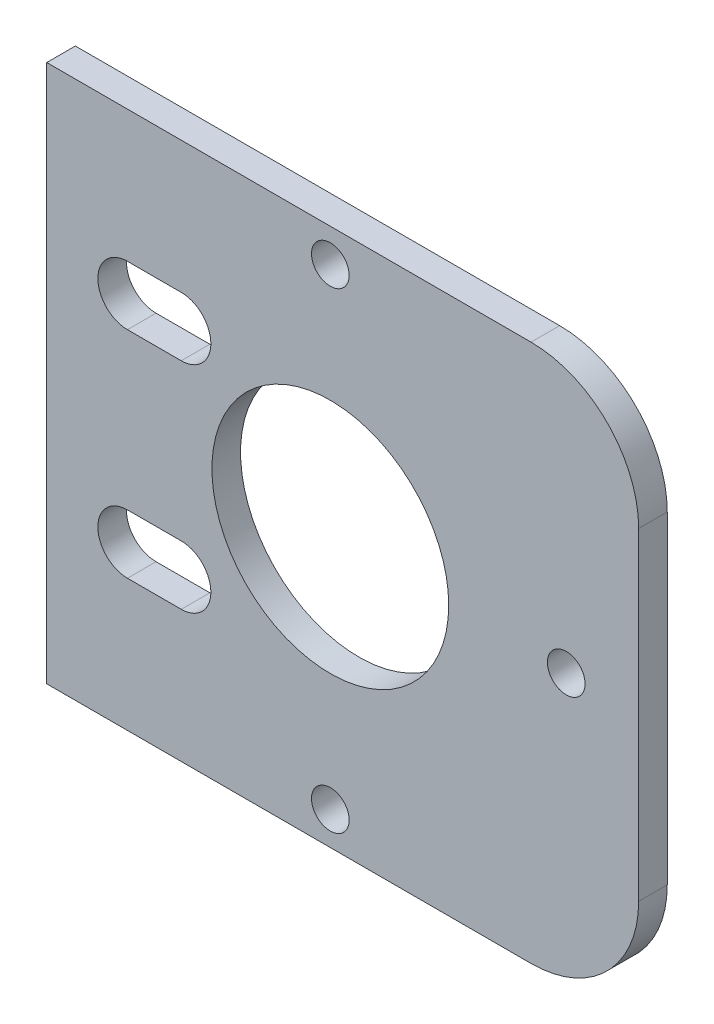
ISO-10303-21;
HEADER;
FILE_DESCRIPTION(('STEP AP214'),'2;1');
FILE_NAME('part.step','',(''),(''),'','','');
FILE_SCHEMA(('AUTOMOTIVE_DESIGN { 1 0 10303 214 1 1 1 1 }'));
ENDSEC;
DATA;
#1=APPLICATION_CONTEXT('core data for automotive mechanical design processes');
#2=APPLICATION_PROTOCOL_DEFINITION('international standard','automotive_design',2000,#1);
#3=PRODUCT_CONTEXT('',#1,'mechanical');
#4=PRODUCT('Part','Part','',(#3));
#5=PRODUCT_RELATED_PRODUCT_CATEGORY('part','',(#4));
#6=PRODUCT_DEFINITION_FORMATION('','',#4);
#7=PRODUCT_DEFINITION_CONTEXT('part definition',#1,'design');
#8=PRODUCT_DEFINITION('design','',#6,#7);
#9=PRODUCT_DEFINITION_SHAPE('','',#8);
#10=(LENGTH_UNIT() NAMED_UNIT(*) SI_UNIT(.MILLI.,.METRE.));
#11=(NAMED_UNIT(*) PLANE_ANGLE_UNIT() SI_UNIT($,.RADIAN.));
#12=(NAMED_UNIT(*) SI_UNIT($,.STERADIAN.) SOLID_ANGLE_UNIT());
#13=UNCERTAINTY_MEASURE_WITH_UNIT(LENGTH_MEASURE(1.E-05),#10,'distance_accuracy_value','');
#14=(GEOMETRIC_REPRESENTATION_CONTEXT(3) GLOBAL_UNCERTAINTY_ASSIGNED_CONTEXT((#13)) GLOBAL_UNIT_ASSIGNED_CONTEXT((#10,
#11,#12)) REPRESENTATION_CONTEXT('',''));
#15=CARTESIAN_POINT('',(0.,0.,0.));
#16=DIRECTION('',(0.,0.,1.));
#17=DIRECTION('',(1.,0.,0.));
#18=AXIS2_PLACEMENT_3D('',#15,#16,#17);
#19=CARTESIAN_POINT('',(17.5,0.,2.65684));
#20=DIRECTION('',(0.,0.,1.));
#21=DIRECTION('',(1.,0.,0.));
#22=AXIS2_PLACEMENT_3D('',#19,#20,#21);
#23=PLANE('',#22);
#24=DIRECTION('',(0.,-1.,0.));
#25=VECTOR('',#24,1.);
#26=CARTESIAN_POINT('',(-10.,25.,2.65684));
#27=LINE('',#26,#25);
#28=CARTESIAN_POINT('',(-10.,-25.,2.65684));
#29=VERTEX_POINT('',#28);
#30=CARTESIAN_POINT('',(-10.,25.,2.65684));
#31=VERTEX_POINT('',#30);
#32=EDGE_CURVE('E160',#29,#31,#27,.F.);
#33=ORIENTED_EDGE('',*,*,#32,.F.);
#34=DIRECTION('',(1.,0.,0.));
#35=VECTOR('',#34,1.);
#36=CARTESIAN_POINT('',(-10.,-25.,2.65684));
#37=LINE('',#36,#35);
#38=CARTESIAN_POINT('',(35.,-25.,2.65684));
#39=VERTEX_POINT('',#38);
#40=EDGE_CURVE('E153',#39,#29,#37,.F.);
#41=ORIENTED_EDGE('',*,*,#40,.F.);
#42=CARTESIAN_POINT('',(35.,-15.,2.65684));
#43=DIRECTION('',(0.,0.,1.));
#44=DIRECTION('',(1.,0.,0.));
#45=AXIS2_PLACEMENT_3D('',#42,#43,#44);
#46=CIRCLE('',#45,10.);
#47=CARTESIAN_POINT('',(45.,-15.,2.65684));
#48=VERTEX_POINT('',#47);
#49=EDGE_CURVE('E125',#48,#39,#46,.F.);
#50=ORIENTED_EDGE('',*,*,#49,.F.);
#51=DIRECTION('',(0.,1.,0.));
#52=VECTOR('',#51,1.);
#53=CARTESIAN_POINT('',(45.,-25.,2.65684));
#54=LINE('',#53,#52);
#55=CARTESIAN_POINT('',(45.,15.,2.65684));
#56=VERTEX_POINT('',#55);
#57=EDGE_CURVE('E120',#56,#48,#54,.F.);
#58=ORIENTED_EDGE('',*,*,#57,.F.);
#59=CARTESIAN_POINT('',(35.,15.,2.65684));
#60=DIRECTION('',(0.,0.,1.));
#61=DIRECTION('',(1.,0.,0.));
#62=AXIS2_PLACEMENT_3D('',#59,#60,#61);
#63=CIRCLE('',#62,10.);
#64=CARTESIAN_POINT('',(35.,25.,2.65684));
#65=VERTEX_POINT('',#64);
#66=EDGE_CURVE('E19',#65,#56,#63,.F.);
#67=ORIENTED_EDGE('',*,*,#66,.F.);
#68=DIRECTION('',(-1.,0.,0.));
#69=VECTOR('',#68,1.);
#70=CARTESIAN_POINT('',(45.,25.,2.65684));
#71=LINE('',#70,#69);
#72=EDGE_CURVE('E134',#31,#65,#71,.F.);
#73=ORIENTED_EDGE('',*,*,#72,.F.);
#74=EDGE_LOOP('',(#33,#41,#50,#58,#67,#73));
#75=FACE_BOUND('',#74,.T.);
#76=CARTESIAN_POINT('',(38.2703,0.,2.65684));
#77=DIRECTION('',(0.,0.,1.));
#78=DIRECTION('',(1.,0.,0.));
#79=AXIS2_PLACEMENT_3D('',#76,#77,#78);
#80=CIRCLE('',#79,1.75);
#81=CARTESIAN_POINT('',(40.0203,0.,2.65684));
#82=VERTEX_POINT('',#81);
#83=EDGE_CURVE('E197',#82,#82,#80,.F.);
#84=ORIENTED_EDGE('',*,*,#83,.T.);
#85=EDGE_LOOP('',(#84));
#86=FACE_BOUND('',#85,.T.);
#87=CARTESIAN_POINT('',(16.35,21.9203,2.65684));
#88=DIRECTION('',(0.,0.,1.));
#89=DIRECTION('',(1.,0.,0.));
#90=AXIS2_PLACEMENT_3D('',#87,#88,#89);
#91=CIRCLE('',#90,1.75);
#92=CARTESIAN_POINT('',(18.1,21.9203,2.65684));
#93=VERTEX_POINT('',#92);
#94=EDGE_CURVE('E200',#93,#93,#91,.F.);
#95=ORIENTED_EDGE('',*,*,#94,.T.);
#96=EDGE_LOOP('',(#95));
#97=FACE_BOUND('',#96,.T.);
#98=CARTESIAN_POINT('',(16.35,-21.9203,2.65684));
#99=DIRECTION('',(0.,0.,1.));
#100=DIRECTION('',(1.,0.,0.));
#101=AXIS2_PLACEMENT_3D('',#98,#99,#100);
#102=CIRCLE('',#101,1.75);
#103=CARTESIAN_POINT('',(18.1,-21.9203,2.65684));
#104=VERTEX_POINT('',#103);
#105=EDGE_CURVE('E203',#104,#104,#102,.F.);
#106=ORIENTED_EDGE('',*,*,#105,.T.);
#107=EDGE_LOOP('',(#106));
#108=FACE_BOUND('',#107,.T.);
#109=CARTESIAN_POINT('',(2.50000000000001,-10.,2.65684));
#110=DIRECTION('',(0.,0.,1.));
#111=DIRECTION('',(1.,0.,0.));
#112=AXIS2_PLACEMENT_3D('',#109,#110,#111);
#113=CIRCLE('',#112,2.75);
#114=CARTESIAN_POINT('',(2.50000000000001,-7.25,2.65684));
#115=VERTEX_POINT('',#114);
#116=CARTESIAN_POINT('',(2.50000000000001,-12.75,2.65684));
#117=VERTEX_POINT('',#116);
#118=EDGE_CURVE('E210',#115,#117,#113,.F.);
#119=ORIENTED_EDGE('',*,*,#118,.T.);
#120=DIRECTION('',(1.,0.,0.));
#121=VECTOR('',#120,1.);
#122=CARTESIAN_POINT('',(-2.49999999999999,-12.75,2.65684));
#123=LINE('',#122,#121);
#124=CARTESIAN_POINT('',(-2.49999999999999,-12.75,2.65684));
#125=VERTEX_POINT('',#124);
#126=EDGE_CURVE('E142',#117,#125,#123,.F.);
#127=ORIENTED_EDGE('',*,*,#126,.T.);
#128=CARTESIAN_POINT('',(-2.49999999999999,-10.,2.65684));
#129=DIRECTION('',(0.,0.,1.));
#130=DIRECTION('',(1.,0.,0.));
#131=AXIS2_PLACEMENT_3D('',#128,#129,#130);
#132=CIRCLE('',#131,2.75);
#133=CARTESIAN_POINT('',(-2.49999999999999,-7.25,2.65684));
#134=VERTEX_POINT('',#133);
#135=EDGE_CURVE('E207',#125,#134,#132,.F.);
#136=ORIENTED_EDGE('',*,*,#135,.T.);
#137=DIRECTION('',(1.,0.,0.));
#138=VECTOR('',#137,1.);
#139=CARTESIAN_POINT('',(2.50000000000001,-7.25,2.65684));
#140=LINE('',#139,#138);
#141=EDGE_CURVE('E138',#134,#115,#140,.T.);
#142=ORIENTED_EDGE('',*,*,#141,.T.);
#143=EDGE_LOOP('',(#119,#127,#136,#142));
#144=FACE_BOUND('',#143,.T.);
#145=CARTESIAN_POINT('',(-2.49999999999999,10.,2.65684));
#146=DIRECTION('',(0.,0.,1.));
#147=DIRECTION('',(1.,0.,0.));
#148=AXIS2_PLACEMENT_3D('',#145,#146,#147);
#149=CIRCLE('',#148,2.75);
#150=CARTESIAN_POINT('',(-2.49999999999999,7.25,2.65684));
#151=VERTEX_POINT('',#150);
#152=CARTESIAN_POINT('',(-2.49999999999999,12.75,2.65684));
#153=VERTEX_POINT('',#152);
#154=EDGE_CURVE('E215',#151,#153,#149,.F.);
#155=ORIENTED_EDGE('',*,*,#154,.T.);
#156=DIRECTION('',(1.,0.,0.));
#157=VECTOR('',#156,1.);
#158=CARTESIAN_POINT('',(2.50000000000001,12.75,2.65684));
#159=LINE('',#158,#157);
#160=CARTESIAN_POINT('',(2.50000000000001,12.75,2.65684));
#161=VERTEX_POINT('',#160);
#162=EDGE_CURVE('E149',#153,#161,#159,.T.);
#163=ORIENTED_EDGE('',*,*,#162,.T.);
#164=CARTESIAN_POINT('',(2.50000000000001,10.,2.65684));
#165=DIRECTION('',(0.,0.,1.));
#166=DIRECTION('',(1.,0.,0.));
#167=AXIS2_PLACEMENT_3D('',#164,#165,#166);
#168=CIRCLE('',#167,2.75);
#169=CARTESIAN_POINT('',(2.50000000000001,7.25,2.65684));
#170=VERTEX_POINT('',#169);
#171=EDGE_CURVE('E212',#161,#170,#168,.F.);
#172=ORIENTED_EDGE('',*,*,#171,.T.);
#173=DIRECTION('',(1.,0.,0.));
#174=VECTOR('',#173,1.);
#175=CARTESIAN_POINT('',(-2.49999999999999,7.25,2.65684));
#176=LINE('',#175,#174);
#177=EDGE_CURVE('E145',#170,#151,#176,.F.);
#178=ORIENTED_EDGE('',*,*,#177,.T.);
#179=EDGE_LOOP('',(#155,#163,#172,#178));
#180=FACE_BOUND('',#179,.T.);
#181=CARTESIAN_POINT('',(16.35,0.,2.65684));
#182=DIRECTION('',(0.,0.,1.));
#183=DIRECTION('',(1.,0.,0.));
#184=AXIS2_PLACEMENT_3D('',#181,#182,#183);
#185=CIRCLE('',#184,11.);
#186=CARTESIAN_POINT('',(27.35,0.,2.65684));
#187=VERTEX_POINT('',#186);
#188=EDGE_CURVE('E148',#187,#187,#185,.F.);
#189=ORIENTED_EDGE('',*,*,#188,.T.);
#190=EDGE_LOOP('',(#189));
#191=FACE_BOUND('',#190,.T.);
#192=ADVANCED_FACE('F16',(#75,#86,#97,#108,#144,#180,#191),#23,.T.);
#193=CARTESIAN_POINT('',(45.,-25.,0.));
#194=DIRECTION('',(1.,0.,0.));
#195=DIRECTION('',(0.,1.,0.));
#196=AXIS2_PLACEMENT_3D('',#193,#194,#195);
#197=PLANE('',#196);
#198=DIRECTION('',(0.,0.,1.));
#199=VECTOR('',#198,1.);
#200=CARTESIAN_POINT('',(45.,15.,0.));
#201=LINE('',#200,#199);
#202=CARTESIAN_POINT('',(45.,15.,0.));
#203=VERTEX_POINT('',#202);
#204=EDGE_CURVE('E117',#56,#203,#201,.F.);
#205=ORIENTED_EDGE('',*,*,#204,.F.);
#206=ORIENTED_EDGE('',*,*,#57,.T.);
#207=DIRECTION('',(0.,0.,1.));
#208=VECTOR('',#207,1.);
#209=CARTESIAN_POINT('',(45.,-15.,0.));
#210=LINE('',#209,#208);
#211=CARTESIAN_POINT('',(45.,-15.,0.));
#212=VERTEX_POINT('',#211);
#213=EDGE_CURVE('E218',#212,#48,#210,.T.);
#214=ORIENTED_EDGE('',*,*,#213,.F.);
#215=DIRECTION('',(0.,1.,0.));
#216=VECTOR('',#215,1.);
#217=CARTESIAN_POINT('',(45.,0.,0.));
#218=LINE('',#217,#216);
#219=EDGE_CURVE('E132',#212,#203,#218,.T.);
#220=ORIENTED_EDGE('',*,*,#219,.T.);
#221=EDGE_LOOP('',(#205,#206,#214,#220));
#222=FACE_BOUND('',#221,.T.);
#223=ADVANCED_FACE('F131',(#222),#197,.T.);
#224=CARTESIAN_POINT('',(35.,15.,0.));
#225=DIRECTION('',(0.,0.,1.));
#226=DIRECTION('',(1.,0.,0.));
#227=AXIS2_PLACEMENT_3D('',#224,#225,#226);
#228=CYLINDRICAL_SURFACE('',#227,10.);
#229=CARTESIAN_POINT('',(35.,15.,0.));
#230=DIRECTION('',(0.,0.,1.));
#231=DIRECTION('',(1.,0.,0.));
#232=AXIS2_PLACEMENT_3D('',#229,#230,#231);
#233=CIRCLE('',#232,10.);
#234=CARTESIAN_POINT('',(35.,25.,0.));
#235=VERTEX_POINT('',#234);
#236=EDGE_CURVE('E194',#203,#235,#233,.T.);
#237=ORIENTED_EDGE('',*,*,#236,.T.);
#238=DIRECTION('',(0.,0.,1.));
#239=VECTOR('',#238,1.);
#240=CARTESIAN_POINT('',(35.,25.,0.));
#241=LINE('',#240,#239);
#242=EDGE_CURVE('E119',#65,#235,#241,.F.);
#243=ORIENTED_EDGE('',*,*,#242,.F.);
#244=ORIENTED_EDGE('',*,*,#66,.T.);
#245=ORIENTED_EDGE('',*,*,#204,.T.);
#246=EDGE_LOOP('',(#237,#243,#244,#245));
#247=FACE_BOUND('',#246,.T.);
#248=ADVANCED_FACE('F115',(#247),#228,.T.);
#249=CARTESIAN_POINT('',(45.,25.,0.));
#250=DIRECTION('',(0.,1.,0.));
#251=DIRECTION('',(-1.,0.,0.));
#252=AXIS2_PLACEMENT_3D('',#249,#250,#251);
#253=PLANE('',#252);
#254=DIRECTION('',(0.,0.,1.));
#255=VECTOR('',#254,1.);
#256=CARTESIAN_POINT('',(-10.,25.,0.));
#257=LINE('',#256,#255);
#258=CARTESIAN_POINT('',(-9.99999999999999,25.,0.));
#259=VERTEX_POINT('',#258);
#260=EDGE_CURVE('E157',#31,#259,#257,.F.);
#261=ORIENTED_EDGE('',*,*,#260,.F.);
#262=ORIENTED_EDGE('',*,*,#72,.T.);
#263=ORIENTED_EDGE('',*,*,#242,.T.);
#264=DIRECTION('',(1.,0.,0.));
#265=VECTOR('',#264,1.);
#266=CARTESIAN_POINT('',(17.5,25.,0.));
#267=LINE('',#266,#265);
#268=EDGE_CURVE('E196',#235,#259,#267,.F.);
#269=ORIENTED_EDGE('',*,*,#268,.T.);
#270=EDGE_LOOP('',(#261,#262,#263,#269));
#271=FACE_BOUND('',#270,.T.);
#272=ADVANCED_FACE('F250',(#271),#253,.T.);
#273=CARTESIAN_POINT('',(-10.,25.,0.));
#274=DIRECTION('',(-1.,0.,0.));
#275=DIRECTION('',(0.,-1.,0.));
#276=AXIS2_PLACEMENT_3D('',#273,#274,#275);
#277=PLANE('',#276);
#278=ORIENTED_EDGE('',*,*,#32,.T.);
#279=ORIENTED_EDGE('',*,*,#260,.T.);
#280=DIRECTION('',(0.,1.,0.));
#281=VECTOR('',#280,1.);
#282=CARTESIAN_POINT('',(-9.99999999999999,0.,0.));
#283=LINE('',#282,#281);
#284=CARTESIAN_POINT('',(-9.99999999999999,-25.,0.));
#285=VERTEX_POINT('',#284);
#286=EDGE_CURVE('E232',#259,#285,#283,.F.);
#287=ORIENTED_EDGE('',*,*,#286,.T.);
#288=DIRECTION('',(0.,0.,1.));
#289=VECTOR('',#288,1.);
#290=CARTESIAN_POINT('',(-10.,-25.,0.));
#291=LINE('',#290,#289);
#292=EDGE_CURVE('E156',#29,#285,#291,.F.);
#293=ORIENTED_EDGE('',*,*,#292,.F.);
#294=EDGE_LOOP('',(#278,#279,#287,#293));
#295=FACE_BOUND('',#294,.T.);
#296=ADVANCED_FACE('F242',(#295),#277,.T.);
#297=CARTESIAN_POINT('',(-10.,-25.,0.));
#298=DIRECTION('',(0.,-1.,0.));
#299=DIRECTION('',(1.,0.,0.));
#300=AXIS2_PLACEMENT_3D('',#297,#298,#299);
#301=PLANE('',#300);
#302=ORIENTED_EDGE('',*,*,#292,.T.);
#303=DIRECTION('',(1.,0.,0.));
#304=VECTOR('',#303,1.);
#305=CARTESIAN_POINT('',(17.5,-25.,0.));
#306=LINE('',#305,#304);
#307=CARTESIAN_POINT('',(35.,-25.,0.));
#308=VERTEX_POINT('',#307);
#309=EDGE_CURVE('E193',#285,#308,#306,.T.);
#310=ORIENTED_EDGE('',*,*,#309,.T.);
#311=DIRECTION('',(0.,0.,1.));
#312=VECTOR('',#311,1.);
#313=CARTESIAN_POINT('',(35.,-25.,0.));
#314=LINE('',#313,#312);
#315=EDGE_CURVE('E219',#39,#308,#314,.F.);
#316=ORIENTED_EDGE('',*,*,#315,.F.);
#317=ORIENTED_EDGE('',*,*,#40,.T.);
#318=EDGE_LOOP('',(#302,#310,#316,#317));
#319=FACE_BOUND('',#318,.T.);
#320=ADVANCED_FACE('F292',(#319),#301,.T.);
#321=CARTESIAN_POINT('',(35.,-15.,0.));
#322=DIRECTION('',(0.,0.,1.));
#323=DIRECTION('',(1.,0.,0.));
#324=AXIS2_PLACEMENT_3D('',#321,#322,#323);
#325=CYLINDRICAL_SURFACE('',#324,10.);
#326=CARTESIAN_POINT('',(35.,-15.,0.));
#327=DIRECTION('',(0.,0.,1.));
#328=DIRECTION('',(1.,0.,0.));
#329=AXIS2_PLACEMENT_3D('',#326,#327,#328);
#330=CIRCLE('',#329,10.);
#331=EDGE_CURVE('E190',#308,#212,#330,.T.);
#332=ORIENTED_EDGE('',*,*,#331,.T.);
#333=ORIENTED_EDGE('',*,*,#213,.T.);
#334=ORIENTED_EDGE('',*,*,#49,.T.);
#335=ORIENTED_EDGE('',*,*,#315,.T.);
#336=EDGE_LOOP('',(#332,#333,#334,#335));
#337=FACE_BOUND('',#336,.T.);
#338=ADVANCED_FACE('F293',(#337),#325,.T.);
#339=CARTESIAN_POINT('',(16.35,0.,0.));
#340=DIRECTION('',(0.,0.,1.));
#341=DIRECTION('',(1.,0.,0.));
#342=AXIS2_PLACEMENT_3D('',#339,#340,#341);
#343=CYLINDRICAL_SURFACE('',#342,11.);
#344=CARTESIAN_POINT('',(16.35,0.,0.));
#345=DIRECTION('',(0.,0.,1.));
#346=DIRECTION('',(1.,0.,0.));
#347=AXIS2_PLACEMENT_3D('',#344,#345,#346);
#348=CIRCLE('',#347,11.);
#349=CARTESIAN_POINT('',(27.35,0.,0.));
#350=VERTEX_POINT('',#349);
#351=EDGE_CURVE('E187',#350,#350,#348,.F.);
#352=ORIENTED_EDGE('',*,*,#351,.T.);
#353=EDGE_LOOP('',(#352));
#354=FACE_BOUND('',#353,.T.);
#355=ORIENTED_EDGE('',*,*,#188,.F.);
#356=EDGE_LOOP('',(#355));
#357=FACE_BOUND('',#356,.T.);
#358=ADVANCED_FACE('F295',(#354,#357),#343,.F.);
#359=CARTESIAN_POINT('',(-2.49999999999999,7.25,0.));
#360=DIRECTION('',(0.,-1.,0.));
#361=DIRECTION('',(0.,0.,-1.));
#362=AXIS2_PLACEMENT_3D('',#359,#360,#361);
#363=PLANE('',#362);
#364=DIRECTION('',(0.,0.,1.));
#365=VECTOR('',#364,1.);
#366=CARTESIAN_POINT('',(-2.49999999999999,7.25,0.));
#367=LINE('',#366,#365);
#368=CARTESIAN_POINT('',(-2.49999999999999,7.25,0.));
#369=VERTEX_POINT('',#368);
#370=EDGE_CURVE('E147',#369,#151,#367,.T.);
#371=ORIENTED_EDGE('',*,*,#370,.T.);
#372=ORIENTED_EDGE('',*,*,#177,.F.);
#373=DIRECTION('',(0.,0.,1.));
#374=VECTOR('',#373,1.);
#375=CARTESIAN_POINT('',(2.50000000000001,7.25,0.));
#376=LINE('',#375,#374);
#377=CARTESIAN_POINT('',(2.50000000000001,7.25,0.));
#378=VERTEX_POINT('',#377);
#379=EDGE_CURVE('E141',#170,#378,#376,.F.);
#380=ORIENTED_EDGE('',*,*,#379,.T.);
#381=DIRECTION('',(1.,0.,0.));
#382=VECTOR('',#381,1.);
#383=CARTESIAN_POINT('',(17.5,7.25,0.));
#384=LINE('',#383,#382);
#385=EDGE_CURVE('E186',#378,#369,#384,.F.);
#386=ORIENTED_EDGE('',*,*,#385,.T.);
#387=EDGE_LOOP('',(#371,#372,#380,#386));
#388=FACE_BOUND('',#387,.T.);
#389=ADVANCED_FACE('F275',(#388),#363,.F.);
#390=CARTESIAN_POINT('',(-2.49999999999999,10.,0.));
#391=DIRECTION('',(0.,0.,1.));
#392=DIRECTION('',(1.,0.,0.));
#393=AXIS2_PLACEMENT_3D('',#390,#391,#392);
#394=CYLINDRICAL_SURFACE('',#393,2.75);
#395=DIRECTION('',(0.,0.,1.));
#396=VECTOR('',#395,1.);
#397=CARTESIAN_POINT('',(-2.49999999999999,12.75,0.));
#398=LINE('',#397,#396);
#399=CARTESIAN_POINT('',(-2.49999999999999,12.75,0.));
#400=VERTEX_POINT('',#399);
#401=EDGE_CURVE('E151',#400,#153,#398,.T.);
#402=ORIENTED_EDGE('',*,*,#401,.T.);
#403=ORIENTED_EDGE('',*,*,#154,.F.);
#404=ORIENTED_EDGE('',*,*,#370,.F.);
#405=CARTESIAN_POINT('',(-2.49999999999999,10.,0.));
#406=DIRECTION('',(0.,0.,1.));
#407=DIRECTION('',(1.,0.,0.));
#408=AXIS2_PLACEMENT_3D('',#405,#406,#407);
#409=CIRCLE('',#408,2.75);
#410=EDGE_CURVE('E183',#369,#400,#409,.F.);
#411=ORIENTED_EDGE('',*,*,#410,.T.);
#412=EDGE_LOOP('',(#402,#403,#404,#411));
#413=FACE_BOUND('',#412,.T.);
#414=ADVANCED_FACE('F280',(#413),#394,.F.);
#415=CARTESIAN_POINT('',(2.50000000000001,12.75,0.));
#416=DIRECTION('',(0.,1.,0.));
#417=DIRECTION('',(0.,0.,1.));
#418=AXIS2_PLACEMENT_3D('',#415,#416,#417);
#419=PLANE('',#418);
#420=DIRECTION('',(0.,0.,1.));
#421=VECTOR('',#420,1.);
#422=CARTESIAN_POINT('',(2.50000000000001,12.75,0.));
#423=LINE('',#422,#421);
#424=CARTESIAN_POINT('',(2.50000000000001,12.75,0.));
#425=VERTEX_POINT('',#424);
#426=EDGE_CURVE('E150',#425,#161,#423,.T.);
#427=ORIENTED_EDGE('',*,*,#426,.T.);
#428=ORIENTED_EDGE('',*,*,#162,.F.);
#429=ORIENTED_EDGE('',*,*,#401,.F.);
#430=DIRECTION('',(1.,0.,0.));
#431=VECTOR('',#430,1.);
#432=CARTESIAN_POINT('',(17.5,12.75,0.));
#433=LINE('',#432,#431);
#434=EDGE_CURVE('E182',#400,#425,#433,.T.);
#435=ORIENTED_EDGE('',*,*,#434,.T.);
#436=EDGE_LOOP('',(#427,#428,#429,#435));
#437=FACE_BOUND('',#436,.T.);
#438=ADVANCED_FACE('F343',(#437),#419,.F.);
#439=CARTESIAN_POINT('',(2.50000000000001,10.,0.));
#440=DIRECTION('',(0.,0.,1.));
#441=DIRECTION('',(1.,0.,0.));
#442=AXIS2_PLACEMENT_3D('',#439,#440,#441);
#443=CYLINDRICAL_SURFACE('',#442,2.75);
#444=ORIENTED_EDGE('',*,*,#379,.F.);
#445=ORIENTED_EDGE('',*,*,#171,.F.);
#446=ORIENTED_EDGE('',*,*,#426,.F.);
#447=CARTESIAN_POINT('',(2.50000000000001,10.,0.));
#448=DIRECTION('',(0.,0.,1.));
#449=DIRECTION('',(1.,0.,0.));
#450=AXIS2_PLACEMENT_3D('',#447,#448,#449);
#451=CIRCLE('',#450,2.75);
#452=EDGE_CURVE('E179',#425,#378,#451,.F.);
#453=ORIENTED_EDGE('',*,*,#452,.T.);
#454=EDGE_LOOP('',(#444,#445,#446,#453));
#455=FACE_BOUND('',#454,.T.);
#456=ADVANCED_FACE('F339',(#455),#443,.F.);
#457=CARTESIAN_POINT('',(2.50000000000001,-7.25,0.));
#458=DIRECTION('',(0.,1.,0.));
#459=DIRECTION('',(0.,0.,1.));
#460=AXIS2_PLACEMENT_3D('',#457,#458,#459);
#461=PLANE('',#460);
#462=DIRECTION('',(0.,0.,1.));
#463=VECTOR('',#462,1.);
#464=CARTESIAN_POINT('',(2.50000000000001,-7.25,0.));
#465=LINE('',#464,#463);
#466=CARTESIAN_POINT('',(2.50000000000001,-7.25,0.));
#467=VERTEX_POINT('',#466);
#468=EDGE_CURVE('E140',#467,#115,#465,.T.);
#469=ORIENTED_EDGE('',*,*,#468,.T.);
#470=ORIENTED_EDGE('',*,*,#141,.F.);
#471=DIRECTION('',(0.,0.,1.));
#472=VECTOR('',#471,1.);
#473=CARTESIAN_POINT('',(-2.49999999999999,-7.25,0.));
#474=LINE('',#473,#472);
#475=CARTESIAN_POINT('',(-2.49999999999999,-7.25,0.));
#476=VERTEX_POINT('',#475);
#477=EDGE_CURVE('E206',#134,#476,#474,.F.);
#478=ORIENTED_EDGE('',*,*,#477,.T.);
#479=DIRECTION('',(1.,0.,0.));
#480=VECTOR('',#479,1.);
#481=CARTESIAN_POINT('',(17.5,-7.25,0.));
#482=LINE('',#481,#480);
#483=EDGE_CURVE('E178',#476,#467,#482,.T.);
#484=ORIENTED_EDGE('',*,*,#483,.T.);
#485=EDGE_LOOP('',(#469,#470,#478,#484));
#486=FACE_BOUND('',#485,.T.);
#487=ADVANCED_FACE('F335',(#486),#461,.F.);
#488=CARTESIAN_POINT('',(2.50000000000001,-10.,0.));
#489=DIRECTION('',(0.,0.,1.));
#490=DIRECTION('',(1.,0.,0.));
#491=AXIS2_PLACEMENT_3D('',#488,#489,#490);
#492=CYLINDRICAL_SURFACE('',#491,2.75);
#493=DIRECTION('',(0.,0.,-1.));
#494=VECTOR('',#493,1.);
#495=CARTESIAN_POINT('',(2.50000000000001,-12.75,0.));
#496=LINE('',#495,#494);
#497=CARTESIAN_POINT('',(2.50000000000001,-12.75,0.));
#498=VERTEX_POINT('',#497);
#499=EDGE_CURVE('E144',#498,#117,#496,.F.);
#500=ORIENTED_EDGE('',*,*,#499,.T.);
#501=ORIENTED_EDGE('',*,*,#118,.F.);
#502=ORIENTED_EDGE('',*,*,#468,.F.);
#503=CARTESIAN_POINT('',(2.50000000000001,-10.,0.));
#504=DIRECTION('',(0.,0.,1.));
#505=DIRECTION('',(1.,0.,0.));
#506=AXIS2_PLACEMENT_3D('',#503,#504,#505);
#507=CIRCLE('',#506,2.75);
#508=EDGE_CURVE('E175',#467,#498,#507,.F.);
#509=ORIENTED_EDGE('',*,*,#508,.T.);
#510=EDGE_LOOP('',(#500,#501,#502,#509));
#511=FACE_BOUND('',#510,.T.);
#512=ADVANCED_FACE('F331',(#511),#492,.F.);
#513=CARTESIAN_POINT('',(-2.49999999999999,-12.75,0.));
#514=DIRECTION('',(0.,-1.,0.));
#515=DIRECTION('',(0.,0.,-1.));
#516=AXIS2_PLACEMENT_3D('',#513,#514,#515);
#517=PLANE('',#516);
#518=DIRECTION('',(0.,0.,1.));
#519=VECTOR('',#518,1.);
#520=CARTESIAN_POINT('',(-2.49999999999999,-12.75,0.));
#521=LINE('',#520,#519);
#522=CARTESIAN_POINT('',(-2.49999999999999,-12.75,0.));
#523=VERTEX_POINT('',#522);
#524=EDGE_CURVE('E34',#523,#125,#521,.T.);
#525=ORIENTED_EDGE('',*,*,#524,.T.);
#526=ORIENTED_EDGE('',*,*,#126,.F.);
#527=ORIENTED_EDGE('',*,*,#499,.F.);
#528=DIRECTION('',(1.,0.,0.));
#529=VECTOR('',#528,1.);
#530=CARTESIAN_POINT('',(17.5,-12.75,0.));
#531=LINE('',#530,#529);
#532=EDGE_CURVE('E174',#498,#523,#531,.F.);
#533=ORIENTED_EDGE('',*,*,#532,.T.);
#534=EDGE_LOOP('',(#525,#526,#527,#533));
#535=FACE_BOUND('',#534,.T.);
#536=ADVANCED_FACE('F328',(#535),#517,.F.);
#537=CARTESIAN_POINT('',(-2.49999999999999,-10.,0.));
#538=DIRECTION('',(0.,0.,1.));
#539=DIRECTION('',(1.,0.,0.));
#540=AXIS2_PLACEMENT_3D('',#537,#538,#539);
#541=CYLINDRICAL_SURFACE('',#540,2.75);
#542=ORIENTED_EDGE('',*,*,#477,.F.);
#543=ORIENTED_EDGE('',*,*,#135,.F.);
#544=ORIENTED_EDGE('',*,*,#524,.F.);
#545=CARTESIAN_POINT('',(-2.49999999999999,-10.,0.));
#546=DIRECTION('',(0.,0.,1.));
#547=DIRECTION('',(1.,0.,0.));
#548=AXIS2_PLACEMENT_3D('',#545,#546,#547);
#549=CIRCLE('',#548,2.75);
#550=EDGE_CURVE('E172',#523,#476,#549,.F.);
#551=ORIENTED_EDGE('',*,*,#550,.T.);
#552=EDGE_LOOP('',(#542,#543,#544,#551));
#553=FACE_BOUND('',#552,.T.);
#554=ADVANCED_FACE('F324',(#553),#541,.F.);
#555=CARTESIAN_POINT('',(16.35,-21.9203,0.));
#556=DIRECTION('',(0.,0.,1.));
#557=DIRECTION('',(1.,0.,0.));
#558=AXIS2_PLACEMENT_3D('',#555,#556,#557);
#559=CYLINDRICAL_SURFACE('',#558,1.75);
#560=CARTESIAN_POINT('',(16.35,-21.9203,0.));
#561=DIRECTION('',(0.,0.,1.));
#562=DIRECTION('',(1.,0.,0.));
#563=AXIS2_PLACEMENT_3D('',#560,#561,#562);
#564=CIRCLE('',#563,1.75);
#565=CARTESIAN_POINT('',(18.1,-21.9203,0.));
#566=VERTEX_POINT('',#565);
#567=EDGE_CURVE('E169',#566,#566,#564,.F.);
#568=ORIENTED_EDGE('',*,*,#567,.T.);
#569=EDGE_LOOP('',(#568));
#570=FACE_BOUND('',#569,.T.);
#571=ORIENTED_EDGE('',*,*,#105,.F.);
#572=EDGE_LOOP('',(#571));
#573=FACE_BOUND('',#572,.T.);
#574=ADVANCED_FACE('F320',(#570,#573),#559,.F.);
#575=CARTESIAN_POINT('',(16.35,21.9203,0.));
#576=DIRECTION('',(0.,0.,1.));
#577=DIRECTION('',(1.,0.,0.));
#578=AXIS2_PLACEMENT_3D('',#575,#576,#577);
#579=CYLINDRICAL_SURFACE('',#578,1.75);
#580=CARTESIAN_POINT('',(16.35,21.9203,0.));
#581=DIRECTION('',(0.,0.,1.));
#582=DIRECTION('',(1.,0.,0.));
#583=AXIS2_PLACEMENT_3D('',#580,#581,#582);
#584=CIRCLE('',#583,1.75);
#585=CARTESIAN_POINT('',(18.1,21.9203,0.));
#586=VERTEX_POINT('',#585);
#587=EDGE_CURVE('E25',#586,#586,#584,.F.);
#588=ORIENTED_EDGE('',*,*,#587,.T.);
#589=EDGE_LOOP('',(#588));
#590=FACE_BOUND('',#589,.T.);
#591=ORIENTED_EDGE('',*,*,#94,.F.);
#592=EDGE_LOOP('',(#591));
#593=FACE_BOUND('',#592,.T.);
#594=ADVANCED_FACE('F312',(#590,#593),#579,.F.);
#595=CARTESIAN_POINT('',(38.2703,0.,0.));
#596=DIRECTION('',(0.,0.,1.));
#597=DIRECTION('',(1.,0.,0.));
#598=AXIS2_PLACEMENT_3D('',#595,#596,#597);
#599=CYLINDRICAL_SURFACE('',#598,1.75);
#600=CARTESIAN_POINT('',(38.2703,0.,0.));
#601=DIRECTION('',(0.,0.,1.));
#602=DIRECTION('',(1.,0.,0.));
#603=AXIS2_PLACEMENT_3D('',#600,#601,#602);
#604=CIRCLE('',#603,1.75);
#605=CARTESIAN_POINT('',(40.0203,0.,0.));
#606=VERTEX_POINT('',#605);
#607=EDGE_CURVE('E11',#606,#606,#604,.F.);
#608=ORIENTED_EDGE('',*,*,#607,.T.);
#609=EDGE_LOOP('',(#608));
#610=FACE_BOUND('',#609,.T.);
#611=ORIENTED_EDGE('',*,*,#83,.F.);
#612=EDGE_LOOP('',(#611));
#613=FACE_BOUND('',#612,.T.);
#614=ADVANCED_FACE('F306',(#610,#613),#599,.F.);
#615=CARTESIAN_POINT('',(17.5,0.,0.));
#616=DIRECTION('',(0.,0.,1.));
#617=DIRECTION('',(1.,0.,0.));
#618=AXIS2_PLACEMENT_3D('',#615,#616,#617);
#619=PLANE('',#618);
#620=ORIENTED_EDGE('',*,*,#607,.F.);
#621=EDGE_LOOP('',(#620));
#622=FACE_BOUND('',#621,.T.);
#623=ORIENTED_EDGE('',*,*,#587,.F.);
#624=EDGE_LOOP('',(#623));
#625=FACE_BOUND('',#624,.T.);
#626=ORIENTED_EDGE('',*,*,#567,.F.);
#627=EDGE_LOOP('',(#626));
#628=FACE_BOUND('',#627,.T.);
#629=ORIENTED_EDGE('',*,*,#532,.F.);
#630=ORIENTED_EDGE('',*,*,#508,.F.);
#631=ORIENTED_EDGE('',*,*,#483,.F.);
#632=ORIENTED_EDGE('',*,*,#550,.F.);
#633=EDGE_LOOP('',(#629,#630,#631,#632));
#634=FACE_BOUND('',#633,.T.);
#635=ORIENTED_EDGE('',*,*,#434,.F.);
#636=ORIENTED_EDGE('',*,*,#410,.F.);
#637=ORIENTED_EDGE('',*,*,#385,.F.);
#638=ORIENTED_EDGE('',*,*,#452,.F.);
#639=EDGE_LOOP('',(#635,#636,#637,#638));
#640=FACE_BOUND('',#639,.T.);
#641=ORIENTED_EDGE('',*,*,#351,.F.);
#642=EDGE_LOOP('',(#641));
#643=FACE_BOUND('',#642,.T.);
#644=ORIENTED_EDGE('',*,*,#309,.F.);
#645=ORIENTED_EDGE('',*,*,#286,.F.);
#646=ORIENTED_EDGE('',*,*,#268,.F.);
#647=ORIENTED_EDGE('',*,*,#236,.F.);
#648=ORIENTED_EDGE('',*,*,#219,.F.);
#649=ORIENTED_EDGE('',*,*,#331,.F.);
#650=EDGE_LOOP('',(#644,#645,#646,#647,#648,#649));
#651=FACE_BOUND('',#650,.T.);
#652=ADVANCED_FACE('F248',(#622,#625,#628,#634,#640,#643,#651),#619,.F.);
#653=CLOSED_SHELL('',(#192,#223,#248,#272,#296,#320,#338,#358,#389,#414,#438,#456,#487,#512,
#536,#554,#574,#594,#614,#652));
#654=MANIFOLD_SOLID_BREP('B1',#653);
#655=ADVANCED_BREP_SHAPE_REPRESENTATION('',(#18,#654),#14);
#656=SHAPE_DEFINITION_REPRESENTATION(#9,#655);
ENDSEC;
END-ISO-10303-21;
